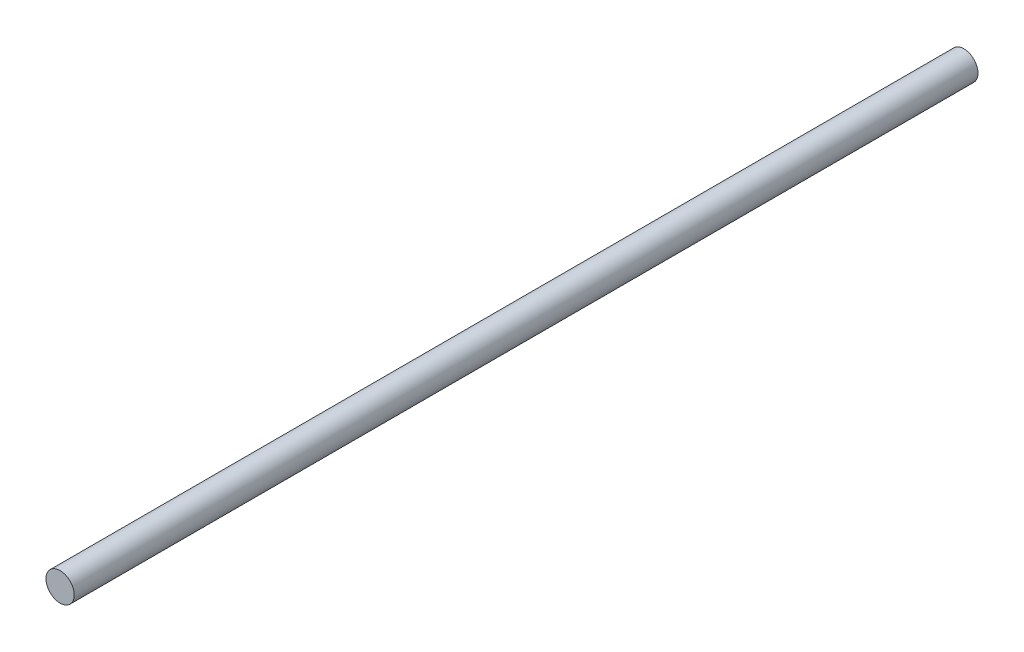
ISO-10303-21;
HEADER;
FILE_DESCRIPTION(('STEP AP214'),'2;1');
FILE_NAME('part.step','',(''),(''),'','','');
FILE_SCHEMA(('AUTOMOTIVE_DESIGN { 1 0 10303 214 1 1 1 1 }'));
ENDSEC;
DATA;
#1=APPLICATION_CONTEXT('core data for automotive mechanical design processes');
#2=APPLICATION_PROTOCOL_DEFINITION('international standard','automotive_design',2000,#1);
#3=PRODUCT_CONTEXT('',#1,'mechanical');
#4=PRODUCT('Part','Part','',(#3));
#5=PRODUCT_RELATED_PRODUCT_CATEGORY('part','',(#4));
#6=PRODUCT_DEFINITION_FORMATION('','',#4);
#7=PRODUCT_DEFINITION_CONTEXT('part definition',#1,'design');
#8=PRODUCT_DEFINITION('design','',#6,#7);
#9=PRODUCT_DEFINITION_SHAPE('','',#8);
#10=(LENGTH_UNIT() NAMED_UNIT(*) SI_UNIT(.MILLI.,.METRE.));
#11=(NAMED_UNIT(*) PLANE_ANGLE_UNIT() SI_UNIT($,.RADIAN.));
#12=(NAMED_UNIT(*) SI_UNIT($,.STERADIAN.) SOLID_ANGLE_UNIT());
#13=UNCERTAINTY_MEASURE_WITH_UNIT(LENGTH_MEASURE(1.E-05),#10,'distance_accuracy_value','');
#14=(GEOMETRIC_REPRESENTATION_CONTEXT(3) GLOBAL_UNCERTAINTY_ASSIGNED_CONTEXT((#13)) GLOBAL_UNIT_ASSIGNED_CONTEXT((#10,
#11,#12)) REPRESENTATION_CONTEXT('',''));
#15=CARTESIAN_POINT('',(0.,0.,0.));
#16=DIRECTION('',(0.,0.,1.));
#17=DIRECTION('',(1.,0.,0.));
#18=AXIS2_PLACEMENT_3D('',#15,#16,#17);
#19=CARTESIAN_POINT('',(0.,0.,203.2));
#20=DIRECTION('',(0.,0.,-1.));
#21=DIRECTION('',(-1.,0.,0.));
#22=AXIS2_PLACEMENT_3D('',#19,#20,#21);
#23=CYLINDRICAL_SURFACE('',#22,6.35);
#24=CARTESIAN_POINT('',(0.,0.,203.2));
#25=DIRECTION('',(0.,0.,1.));
#26=DIRECTION('',(1.,0.,0.));
#27=AXIS2_PLACEMENT_3D('',#24,#25,#26);
#28=CIRCLE('',#27,6.35);
#29=CARTESIAN_POINT('',(6.35,0.,203.2));
#30=VERTEX_POINT('',#29);
#31=EDGE_CURVE('E10',#30,#30,#28,.T.);
#32=ORIENTED_EDGE('',*,*,#31,.F.);
#33=EDGE_LOOP('',(#32));
#34=FACE_BOUND('',#33,.T.);
#35=CARTESIAN_POINT('',(0.,0.,-203.2));
#36=DIRECTION('',(0.,0.,1.));
#37=DIRECTION('',(1.,0.,0.));
#38=AXIS2_PLACEMENT_3D('',#35,#36,#37);
#39=CIRCLE('',#38,6.35);
#40=CARTESIAN_POINT('',(6.35,0.,-203.2));
#41=VERTEX_POINT('',#40);
#42=EDGE_CURVE('E40',#41,#41,#39,.T.);
#43=ORIENTED_EDGE('',*,*,#42,.T.);
#44=EDGE_LOOP('',(#43));
#45=FACE_BOUND('',#44,.T.);
#46=ADVANCED_FACE('F37',(#34,#45),#23,.T.);
#47=CARTESIAN_POINT('',(0.,0.,203.2));
#48=DIRECTION('',(0.,0.,1.));
#49=DIRECTION('',(1.,0.,0.));
#50=AXIS2_PLACEMENT_3D('',#47,#48,#49);
#51=PLANE('',#50);
#52=ORIENTED_EDGE('',*,*,#31,.T.);
#53=EDGE_LOOP('',(#52));
#54=FACE_BOUND('',#53,.T.);
#55=ADVANCED_FACE('F54',(#54),#51,.T.);
#56=CARTESIAN_POINT('',(0.,0.,-203.2));
#57=DIRECTION('',(0.,0.,1.));
#58=DIRECTION('',(1.,0.,0.));
#59=AXIS2_PLACEMENT_3D('',#56,#57,#58);
#60=PLANE('',#59);
#61=ORIENTED_EDGE('',*,*,#42,.F.);
#62=EDGE_LOOP('',(#61));
#63=FACE_BOUND('',#62,.T.);
#64=ADVANCED_FACE('F52',(#63),#60,.F.);
#65=CLOSED_SHELL('',(#46,#55,#64));
#66=MANIFOLD_SOLID_BREP('B2',#65);
#67=ADVANCED_BREP_SHAPE_REPRESENTATION('',(#18,#66),#14);
#68=SHAPE_DEFINITION_REPRESENTATION(#9,#67);
ENDSEC;
END-ISO-10303-21;
